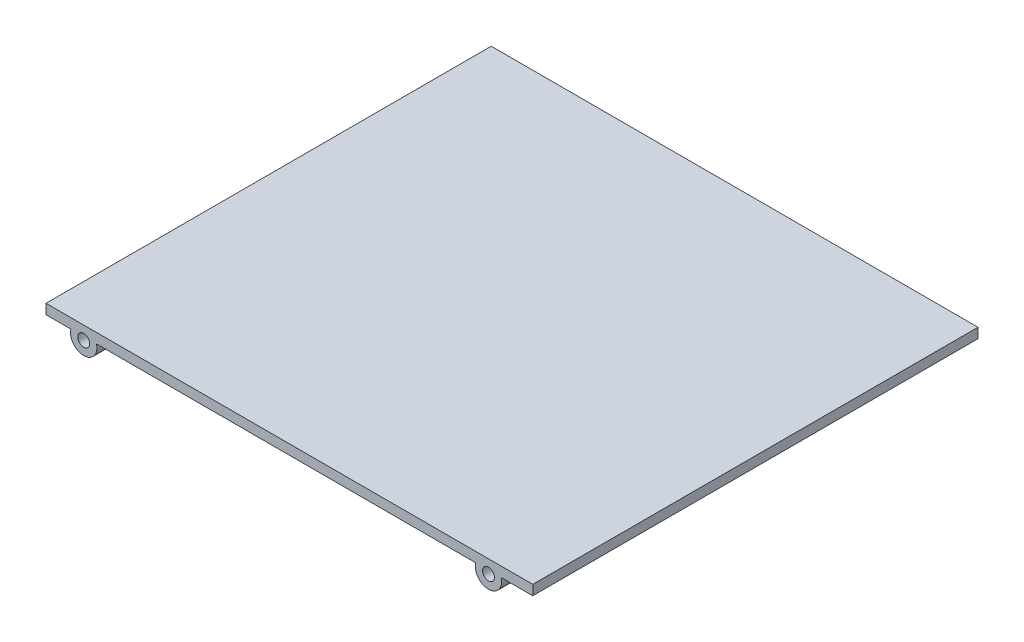
ISO-10303-21;
HEADER;
FILE_DESCRIPTION(('STEP AP214'),'2;1');
FILE_NAME('part.step','',(''),(''),'','','');
FILE_SCHEMA(('AUTOMOTIVE_DESIGN { 1 0 10303 214 1 1 1 1 }'));
ENDSEC;
DATA;
#1=APPLICATION_CONTEXT('core data for automotive mechanical design processes');
#2=APPLICATION_PROTOCOL_DEFINITION('international standard','automotive_design',2000,#1);
#3=PRODUCT_CONTEXT('',#1,'mechanical');
#4=PRODUCT('Part','Part','',(#3));
#5=PRODUCT_RELATED_PRODUCT_CATEGORY('part','',(#4));
#6=PRODUCT_DEFINITION_FORMATION('','',#4);
#7=PRODUCT_DEFINITION_CONTEXT('part definition',#1,'design');
#8=PRODUCT_DEFINITION('design','',#6,#7);
#9=PRODUCT_DEFINITION_SHAPE('','',#8);
#10=(LENGTH_UNIT() NAMED_UNIT(*) SI_UNIT(.MILLI.,.METRE.));
#11=(NAMED_UNIT(*) PLANE_ANGLE_UNIT() SI_UNIT($,.RADIAN.));
#12=(NAMED_UNIT(*) SI_UNIT($,.STERADIAN.) SOLID_ANGLE_UNIT());
#13=UNCERTAINTY_MEASURE_WITH_UNIT(LENGTH_MEASURE(1.E-05),#10,'distance_accuracy_value','');
#14=(GEOMETRIC_REPRESENTATION_CONTEXT(3) GLOBAL_UNCERTAINTY_ASSIGNED_CONTEXT((#13)) GLOBAL_UNIT_ASSIGNED_CONTEXT((#10,
#11,#12)) REPRESENTATION_CONTEXT('',''));
#15=CARTESIAN_POINT('',(0.,0.,0.));
#16=DIRECTION('',(0.,0.,1.));
#17=DIRECTION('',(1.,0.,0.));
#18=AXIS2_PLACEMENT_3D('',#15,#16,#17);
#19=CARTESIAN_POINT('',(-215.790530374135,19.6324924250548,141.061835141856));
#20=DIRECTION('',(-1.,0.,0.));
#21=DIRECTION('',(0.,0.,1.));
#22=AXIS2_PLACEMENT_3D('',#19,#20,#21);
#23=PLANE('',#22);
#24=DIRECTION('',(0.,1.,0.));
#25=VECTOR('',#24,1.);
#26=CARTESIAN_POINT('',(-215.790530374135,19.6324924250548,67.380000000001));
#27=LINE('',#26,#25);
#28=CARTESIAN_POINT('',(-215.790530374135,18.1324924250559,67.380000000001));
#29=VERTEX_POINT('',#28);
#30=CARTESIAN_POINT('',(-215.790530374135,19.6324924250548,67.3800000000009));
#31=VERTEX_POINT('',#30);
#32=EDGE_CURVE('E220',#29,#31,#27,.T.);
#33=ORIENTED_EDGE('',*,*,#32,.F.);
#34=DIRECTION('',(0.,0.,-1.));
#35=VECTOR('',#34,1.);
#36=CARTESIAN_POINT('',(-215.790530374135,18.1324924250559,141.061835141856));
#37=LINE('',#36,#35);
#38=CARTESIAN_POINT('',(-215.790530374135,18.1324924250559,0.));
#39=VERTEX_POINT('',#38);
#40=EDGE_CURVE('E202',#29,#39,#37,.T.);
#41=ORIENTED_EDGE('',*,*,#40,.T.);
#42=DIRECTION('',(0.,1.,0.));
#43=VECTOR('',#42,1.);
#44=CARTESIAN_POINT('',(-215.790530374135,19.6324924250548,0.));
#45=LINE('',#44,#43);
#46=CARTESIAN_POINT('',(-215.790530374135,19.6324924250548,0.));
#47=VERTEX_POINT('',#46);
#48=EDGE_CURVE('E205',#39,#47,#45,.T.);
#49=ORIENTED_EDGE('',*,*,#48,.T.);
#50=DIRECTION('',(0.,0.,-1.));
#51=VECTOR('',#50,1.);
#52=CARTESIAN_POINT('',(-215.790530374135,19.6324924250548,141.061835141856));
#53=LINE('',#52,#51);
#54=EDGE_CURVE('E215',#31,#47,#53,.T.);
#55=ORIENTED_EDGE('',*,*,#54,.F.);
#56=EDGE_LOOP('',(#33,#41,#49,#55));
#57=FACE_BOUND('',#56,.T.);
#58=ADVANCED_FACE('F39',(#57),#23,.F.);
#59=CARTESIAN_POINT('',(-289.457095584354,19.6324924250548,141.061835141856));
#60=DIRECTION('',(0.,-1.,0.));
#61=DIRECTION('',(0.,0.,-1.));
#62=AXIS2_PLACEMENT_3D('',#59,#60,#61);
#63=PLANE('',#62);
#64=DIRECTION('',(0.,0.,-1.));
#65=VECTOR('',#64,1.);
#66=CARTESIAN_POINT('',(-289.457095584354,19.6324924250548,141.061835141856));
#67=LINE('',#66,#65);
#68=CARTESIAN_POINT('',(-289.457095584354,19.6324924250548,67.3800000000009));
#69=VERTEX_POINT('',#68);
#70=CARTESIAN_POINT('',(-289.457095584354,19.6324924250548,0.));
#71=VERTEX_POINT('',#70);
#72=EDGE_CURVE('E211',#69,#71,#67,.T.);
#73=ORIENTED_EDGE('',*,*,#72,.F.);
#74=DIRECTION('',(-1.,0.,0.));
#75=VECTOR('',#74,1.);
#76=CARTESIAN_POINT('',(-289.457095584354,19.6324924250548,67.3800000000009));
#77=LINE('',#76,#75);
#78=EDGE_CURVE('E225',#31,#69,#77,.T.);
#79=ORIENTED_EDGE('',*,*,#78,.F.);
#80=ORIENTED_EDGE('',*,*,#54,.T.);
#81=DIRECTION('',(-1.,0.,0.));
#82=VECTOR('',#81,1.);
#83=CARTESIAN_POINT('',(-289.457095584354,19.6324924250548,0.));
#84=LINE('',#83,#82);
#85=EDGE_CURVE('E214',#47,#71,#84,.T.);
#86=ORIENTED_EDGE('',*,*,#85,.T.);
#87=EDGE_LOOP('',(#73,#79,#80,#86));
#88=FACE_BOUND('',#87,.T.);
#89=ADVANCED_FACE('F319',(#88),#63,.F.);
#90=CARTESIAN_POINT('',(-289.457095584354,18.132492425055,141.061835141856));
#91=DIRECTION('',(1.,0.,0.));
#92=DIRECTION('',(0.,1.,0.));
#93=AXIS2_PLACEMENT_3D('',#90,#91,#92);
#94=PLANE('',#93);
#95=DIRECTION('',(0.,-1.,0.));
#96=VECTOR('',#95,1.);
#97=CARTESIAN_POINT('',(-289.457095584354,18.132492425055,67.3800000000009));
#98=LINE('',#97,#96);
#99=CARTESIAN_POINT('',(-289.457095584354,18.132492425055,67.3800000000009));
#100=VERTEX_POINT('',#99);
#101=EDGE_CURVE('E227',#69,#100,#98,.T.);
#102=ORIENTED_EDGE('',*,*,#101,.F.);
#103=ORIENTED_EDGE('',*,*,#72,.T.);
#104=DIRECTION('',(0.,-1.,0.));
#105=VECTOR('',#104,1.);
#106=CARTESIAN_POINT('',(-289.457095584354,18.132492425055,0.));
#107=LINE('',#106,#105);
#108=CARTESIAN_POINT('',(-289.457095584354,18.132492425055,0.));
#109=VERTEX_POINT('',#108);
#110=EDGE_CURVE('E210',#71,#109,#107,.T.);
#111=ORIENTED_EDGE('',*,*,#110,.T.);
#112=DIRECTION('',(0.,0.,-1.));
#113=VECTOR('',#112,1.);
#114=CARTESIAN_POINT('',(-289.457095584354,18.132492425055,141.061835141856));
#115=LINE('',#114,#113);
#116=EDGE_CURVE('E207',#100,#109,#115,.T.);
#117=ORIENTED_EDGE('',*,*,#116,.F.);
#118=EDGE_LOOP('',(#102,#103,#111,#117));
#119=FACE_BOUND('',#118,.T.);
#120=ADVANCED_FACE('F325',(#119),#94,.F.);
#121=CARTESIAN_POINT('',(-215.790530374135,18.1324924250559,141.061835141856));
#122=DIRECTION('',(0.,1.,0.));
#123=DIRECTION('',(-1.,0.,0.));
#124=AXIS2_PLACEMENT_3D('',#121,#122,#123);
#125=PLANE('',#124);
#126=DIRECTION('',(1.,0.,0.));
#127=VECTOR('',#126,1.);
#128=CARTESIAN_POINT('',(-215.790530374135,18.1324924250559,59.3800000000013));
#129=LINE('',#128,#127);
#130=CARTESIAN_POINT('',(-224.428044512183,18.1324924250558,59.3800000000013));
#131=VERTEX_POINT('',#130);
#132=CARTESIAN_POINT('',(-223.239884316434,18.1324924250558,59.3800000000013));
#133=VERTEX_POINT('',#132);
#134=EDGE_CURVE('E155',#131,#133,#129,.T.);
#135=ORIENTED_EDGE('',*,*,#134,.F.);
#136=DIRECTION('',(0.,0.,1.));
#137=VECTOR('',#136,1.);
#138=CARTESIAN_POINT('',(-224.428044512183,18.1324924250558,59.3800000000013));
#139=LINE('',#138,#137);
#140=CARTESIAN_POINT('',(-224.428044512183,18.1324924250558,67.3800000000013));
#141=VERTEX_POINT('',#140);
#142=EDGE_CURVE('E266',#131,#141,#139,.T.);
#143=ORIENTED_EDGE('',*,*,#142,.T.);
#144=DIRECTION('',(1.,0.,0.));
#145=VECTOR('',#144,1.);
#146=CARTESIAN_POINT('',(-215.790530374135,18.1324924250559,67.380000000001));
#147=LINE('',#146,#145);
#148=CARTESIAN_POINT('',(-281.813961070135,18.1324924250551,67.3800000000009));
#149=VERTEX_POINT('',#148);
#150=EDGE_CURVE('E221',#149,#141,#147,.T.);
#151=ORIENTED_EDGE('',*,*,#150,.F.);
#152=DIRECTION('',(0.,0.,1.));
#153=VECTOR('',#152,1.);
#154=CARTESIAN_POINT('',(-281.813961070135,18.1324924250551,59.3800000000013));
#155=LINE('',#154,#153);
#156=CARTESIAN_POINT('',(-281.813961070135,18.1324924250551,59.3800000000013));
#157=VERTEX_POINT('',#156);
#158=EDGE_CURVE('E280',#149,#157,#155,.F.);
#159=ORIENTED_EDGE('',*,*,#158,.T.);
#160=DIRECTION('',(1.,0.,0.));
#161=VECTOR('',#160,1.);
#162=CARTESIAN_POINT('',(-215.790530374135,18.1324924250559,59.3800000000013));
#163=LINE('',#162,#161);
#164=CARTESIAN_POINT('',(-283.002121265884,18.1324924250551,59.3800000000013));
#165=VERTEX_POINT('',#164);
#166=EDGE_CURVE('E177',#165,#157,#163,.T.);
#167=ORIENTED_EDGE('',*,*,#166,.F.);
#168=CARTESIAN_POINT('',(-284.498784220593,18.1324924250551,59.3800000000013));
#169=VERTEX_POINT('',#168);
#170=EDGE_CURVE('E176',#169,#165,#163,.T.);
#171=ORIENTED_EDGE('',*,*,#170,.F.);
#172=CARTESIAN_POINT('',(-285.686944416343,18.1324924250551,59.3800000000013));
#173=VERTEX_POINT('',#172);
#174=EDGE_CURVE('E174',#173,#169,#163,.T.);
#175=ORIENTED_EDGE('',*,*,#174,.F.);
#176=DIRECTION('',(0.,0.,1.));
#177=VECTOR('',#176,1.);
#178=CARTESIAN_POINT('',(-285.686944416343,18.1324924250551,59.3800000000013));
#179=LINE('',#178,#177);
#180=CARTESIAN_POINT('',(-285.686944416343,18.1324924250551,67.3800000000013));
#181=VERTEX_POINT('',#180);
#182=EDGE_CURVE('E277',#173,#181,#179,.T.);
#183=ORIENTED_EDGE('',*,*,#182,.T.);
#184=EDGE_CURVE('E217',#100,#181,#147,.T.);
#185=ORIENTED_EDGE('',*,*,#184,.F.);
#186=ORIENTED_EDGE('',*,*,#116,.T.);
#187=DIRECTION('',(1.,0.,0.));
#188=VECTOR('',#187,1.);
#189=CARTESIAN_POINT('',(-215.790530374135,18.1324924250559,0.));
#190=LINE('',#189,#188);
#191=CARTESIAN_POINT('',(-285.686944416342,18.1324924250551,0.));
#192=VERTEX_POINT('',#191);
#193=EDGE_CURVE('E235',#109,#192,#190,.T.);
#194=ORIENTED_EDGE('',*,*,#193,.T.);
#195=DIRECTION('',(0.,0.,-1.));
#196=VECTOR('',#195,1.);
#197=CARTESIAN_POINT('',(-285.686944416342,18.1324924250551,8.));
#198=LINE('',#197,#196);
#199=CARTESIAN_POINT('',(-285.686944416342,18.1324924250551,8.));
#200=VERTEX_POINT('',#199);
#201=EDGE_CURVE('E240',#192,#200,#198,.F.);
#202=ORIENTED_EDGE('',*,*,#201,.T.);
#203=DIRECTION('',(-1.,0.,0.));
#204=VECTOR('',#203,1.);
#205=CARTESIAN_POINT('',(-215.790530374135,18.1324924250559,8.00000000000001));
#206=LINE('',#205,#204);
#207=CARTESIAN_POINT('',(-284.498784220593,18.1324924250551,8.));
#208=VERTEX_POINT('',#207);
#209=EDGE_CURVE('E197',#208,#200,#206,.T.);
#210=ORIENTED_EDGE('',*,*,#209,.F.);
#211=CARTESIAN_POINT('',(-283.002121265884,18.1324924250551,8.));
#212=VERTEX_POINT('',#211);
#213=EDGE_CURVE('E196',#212,#208,#206,.T.);
#214=ORIENTED_EDGE('',*,*,#213,.F.);
#215=CARTESIAN_POINT('',(-281.813961070134,18.1324924250551,8.));
#216=VERTEX_POINT('',#215);
#217=EDGE_CURVE('E191',#216,#212,#206,.T.);
#218=ORIENTED_EDGE('',*,*,#217,.F.);
#219=DIRECTION('',(0.,0.,-1.));
#220=VECTOR('',#219,1.);
#221=CARTESIAN_POINT('',(-281.813961070134,18.1324924250551,8.));
#222=LINE('',#221,#220);
#223=CARTESIAN_POINT('',(-281.813961070134,18.1324924250551,0.));
#224=VERTEX_POINT('',#223);
#225=EDGE_CURVE('E206',#216,#224,#222,.T.);
#226=ORIENTED_EDGE('',*,*,#225,.T.);
#227=CARTESIAN_POINT('',(-224.428044512183,18.1324924250558,0.));
#228=VERTEX_POINT('',#227);
#229=EDGE_CURVE('E237',#224,#228,#190,.T.);
#230=ORIENTED_EDGE('',*,*,#229,.T.);
#231=DIRECTION('',(0.,0.,-1.));
#232=VECTOR('',#231,1.);
#233=CARTESIAN_POINT('',(-224.428044512183,18.1324924250558,8.));
#234=LINE('',#233,#232);
#235=CARTESIAN_POINT('',(-224.428044512183,18.1324924250558,8.));
#236=VERTEX_POINT('',#235);
#237=EDGE_CURVE('E246',#228,#236,#234,.F.);
#238=ORIENTED_EDGE('',*,*,#237,.T.);
#239=DIRECTION('',(-1.,0.,0.));
#240=VECTOR('',#239,1.);
#241=CARTESIAN_POINT('',(-215.790530374135,18.1324924250559,8.00000000000001));
#242=LINE('',#241,#240);
#243=CARTESIAN_POINT('',(-223.239884316433,18.1324924250558,8.));
#244=VERTEX_POINT('',#243);
#245=EDGE_CURVE('E201',#244,#236,#242,.T.);
#246=ORIENTED_EDGE('',*,*,#245,.F.);
#247=CARTESIAN_POINT('',(-221.743221361725,18.1324924250558,8.));
#248=VERTEX_POINT('',#247);
#249=EDGE_CURVE('E200',#248,#244,#242,.T.);
#250=ORIENTED_EDGE('',*,*,#249,.F.);
#251=CARTESIAN_POINT('',(-220.555061165975,18.1324924250559,8.));
#252=VERTEX_POINT('',#251);
#253=EDGE_CURVE('E198',#252,#248,#242,.T.);
#254=ORIENTED_EDGE('',*,*,#253,.F.);
#255=DIRECTION('',(0.,0.,-1.));
#256=VECTOR('',#255,1.);
#257=CARTESIAN_POINT('',(-220.555061165975,18.1324924250559,8.));
#258=LINE('',#257,#256);
#259=CARTESIAN_POINT('',(-220.555061165975,18.1324924250559,0.));
#260=VERTEX_POINT('',#259);
#261=EDGE_CURVE('E243',#252,#260,#258,.T.);
#262=ORIENTED_EDGE('',*,*,#261,.T.);
#263=EDGE_CURVE('E209',#260,#39,#190,.T.);
#264=ORIENTED_EDGE('',*,*,#263,.T.);
#265=ORIENTED_EDGE('',*,*,#40,.F.);
#266=CARTESIAN_POINT('',(-220.555061165976,18.1324924250559,67.380000000001));
#267=VERTEX_POINT('',#266);
#268=EDGE_CURVE('E222',#267,#29,#147,.T.);
#269=ORIENTED_EDGE('',*,*,#268,.F.);
#270=DIRECTION('',(0.,0.,1.));
#271=VECTOR('',#270,1.);
#272=CARTESIAN_POINT('',(-220.555061165976,18.1324924250559,59.3800000000013));
#273=LINE('',#272,#271);
#274=CARTESIAN_POINT('',(-220.555061165976,18.1324924250559,59.3800000000013));
#275=VERTEX_POINT('',#274);
#276=EDGE_CURVE('E275',#267,#275,#273,.F.);
#277=ORIENTED_EDGE('',*,*,#276,.T.);
#278=CARTESIAN_POINT('',(-221.743221361726,18.1324924250558,59.3800000000013));
#279=VERTEX_POINT('',#278);
#280=EDGE_CURVE('E167',#279,#275,#129,.T.);
#281=ORIENTED_EDGE('',*,*,#280,.F.);
#282=EDGE_CURVE('E159',#133,#279,#129,.T.);
#283=ORIENTED_EDGE('',*,*,#282,.F.);
#284=EDGE_LOOP('',(#135,#143,#151,#159,#167,#171,#175,#183,#185,#186,#194,#202,#210,#214,#218,
#226,#230,#238,#246,#250,#254,#262,#264,#265,#269,#277,#281,#283));
#285=FACE_BOUND('',#284,.T.);
#286=ADVANCED_FACE('F164',(#285),#125,.F.);
#287=CARTESIAN_POINT('',(0.,0.,0.));
#288=DIRECTION('',(0.,0.,-1.));
#289=DIRECTION('',(-1.,0.,0.));
#290=AXIS2_PLACEMENT_3D('',#287,#288,#289);
#291=PLANE('',#290);
#292=CARTESIAN_POINT('',(-222.491552839079,17.6324924250544,0.));
#293=DIRECTION('',(0.,0.,-1.));
#294=DIRECTION('',(-1.,0.,0.));
#295=AXIS2_PLACEMENT_3D('',#292,#293,#294);
#296=CIRCLE('',#295,0.900000000000028);
#297=CARTESIAN_POINT('',(-223.391552839079,17.6324924250544,0.));
#298=VERTEX_POINT('',#297);
#299=EDGE_CURVE('E269',#298,#298,#296,.T.);
#300=ORIENTED_EDGE('',*,*,#299,.F.);
#301=EDGE_LOOP('',(#300));
#302=FACE_BOUND('',#301,.T.);
#303=CARTESIAN_POINT('',(-283.750452743238,17.6324924250544,0.));
#304=DIRECTION('',(0.,0.,-1.));
#305=DIRECTION('',(-1.,0.,0.));
#306=AXIS2_PLACEMENT_3D('',#303,#304,#305);
#307=CIRCLE('',#306,0.900000000000001);
#308=CARTESIAN_POINT('',(-284.650452743238,17.6324924250544,0.));
#309=VERTEX_POINT('',#308);
#310=EDGE_CURVE('E265',#309,#309,#307,.T.);
#311=ORIENTED_EDGE('',*,*,#310,.F.);
#312=EDGE_LOOP('',(#311));
#313=FACE_BOUND('',#312,.T.);
#314=ORIENTED_EDGE('',*,*,#263,.F.);
#315=CARTESIAN_POINT('',(-222.491552839079,17.6324924250544,0.));
#316=DIRECTION('',(0.,0.,-1.));
#317=DIRECTION('',(-1.,0.,0.));
#318=AXIS2_PLACEMENT_3D('',#315,#316,#317);
#319=CIRCLE('',#318,2.00000000000059);
#320=EDGE_CURVE('E253',#260,#228,#319,.T.);
#321=ORIENTED_EDGE('',*,*,#320,.T.);
#322=ORIENTED_EDGE('',*,*,#229,.F.);
#323=CARTESIAN_POINT('',(-283.750452743238,17.6324924250544,0.));
#324=DIRECTION('',(0.,0.,-1.));
#325=DIRECTION('',(-1.,0.,0.));
#326=AXIS2_PLACEMENT_3D('',#323,#324,#325);
#327=CIRCLE('',#326,2.00000000000071);
#328=EDGE_CURVE('E257',#224,#192,#327,.T.);
#329=ORIENTED_EDGE('',*,*,#328,.T.);
#330=ORIENTED_EDGE('',*,*,#193,.F.);
#331=ORIENTED_EDGE('',*,*,#110,.F.);
#332=ORIENTED_EDGE('',*,*,#85,.F.);
#333=ORIENTED_EDGE('',*,*,#48,.F.);
#334=EDGE_LOOP('',(#314,#321,#322,#329,#330,#331,#332,#333));
#335=FACE_BOUND('',#334,.T.);
#336=ADVANCED_FACE('F334',(#302,#313,#335),#291,.T.);
#337=CARTESIAN_POINT('',(-53.15,-0.367507574945569,67.3800000000013));
#338=DIRECTION('',(0.,0.,1.));
#339=DIRECTION('',(0.999885624174656,-0.0151241055556286,0.));
#340=AXIS2_PLACEMENT_3D('',#337,#338,#339);
#341=PLANE('',#340);
#342=CARTESIAN_POINT('',(-283.750452743239,17.6324924250544,67.3800000000013));
#343=DIRECTION('',(0.,0.,1.));
#344=DIRECTION('',(1.,0.,0.));
#345=AXIS2_PLACEMENT_3D('',#342,#343,#344);
#346=CIRCLE('',#345,0.90000000000011);
#347=CARTESIAN_POINT('',(-282.850452743239,17.6324924250544,67.3800000000013));
#348=VERTEX_POINT('',#347);
#349=EDGE_CURVE('E292',#348,#348,#346,.T.);
#350=ORIENTED_EDGE('',*,*,#349,.F.);
#351=EDGE_LOOP('',(#350));
#352=FACE_BOUND('',#351,.T.);
#353=CARTESIAN_POINT('',(-222.49155283908,17.6324924250544,67.3800000000013));
#354=DIRECTION('',(0.,0.,1.));
#355=DIRECTION('',(1.,0.,0.));
#356=AXIS2_PLACEMENT_3D('',#353,#354,#355);
#357=CIRCLE('',#356,0.90000000000011);
#358=CARTESIAN_POINT('',(-221.591552839079,17.6324924250544,67.3800000000013));
#359=VERTEX_POINT('',#358);
#360=EDGE_CURVE('E160',#359,#359,#357,.T.);
#361=ORIENTED_EDGE('',*,*,#360,.F.);
#362=EDGE_LOOP('',(#361));
#363=FACE_BOUND('',#362,.T.);
#364=ORIENTED_EDGE('',*,*,#184,.T.);
#365=CARTESIAN_POINT('',(-283.750452743239,17.6324924250544,67.3800000000013));
#366=DIRECTION('',(0.,0.,1.));
#367=DIRECTION('',(1.,0.,0.));
#368=AXIS2_PLACEMENT_3D('',#365,#366,#367);
#369=CIRCLE('',#368,2.00000000000051);
#370=EDGE_CURVE('E285',#181,#149,#369,.T.);
#371=ORIENTED_EDGE('',*,*,#370,.T.);
#372=ORIENTED_EDGE('',*,*,#150,.T.);
#373=CARTESIAN_POINT('',(-222.49155283908,17.6324924250544,67.3800000000013));
#374=DIRECTION('',(0.,0.,1.));
#375=DIRECTION('',(1.,0.,0.));
#376=AXIS2_PLACEMENT_3D('',#373,#374,#375);
#377=CIRCLE('',#376,2.00000000000033);
#378=EDGE_CURVE('E287',#141,#267,#377,.T.);
#379=ORIENTED_EDGE('',*,*,#378,.T.);
#380=ORIENTED_EDGE('',*,*,#268,.T.);
#381=ORIENTED_EDGE('',*,*,#32,.T.);
#382=ORIENTED_EDGE('',*,*,#78,.T.);
#383=ORIENTED_EDGE('',*,*,#101,.T.);
#384=EDGE_LOOP('',(#364,#371,#372,#379,#380,#381,#382,#383));
#385=FACE_BOUND('',#384,.T.);
#386=ADVANCED_FACE('F41',(#352,#363,#385),#341,.T.);
#387=CARTESIAN_POINT('',(-222.491552839079,17.6324924250544,8.));
#388=DIRECTION('',(0.,0.,-1.));
#389=DIRECTION('',(-1.,0.,0.));
#390=AXIS2_PLACEMENT_3D('',#387,#388,#389);
#391=PLANE('',#390);
#392=ORIENTED_EDGE('',*,*,#253,.T.);
#393=CARTESIAN_POINT('',(-222.491552839079,17.6324924250544,8.));
#394=DIRECTION('',(0.,0.,-1.));
#395=DIRECTION('',(-1.,0.,0.));
#396=AXIS2_PLACEMENT_3D('',#393,#394,#395);
#397=CIRCLE('',#396,0.900000000000028);
#398=EDGE_CURVE('E182',#248,#244,#397,.T.);
#399=ORIENTED_EDGE('',*,*,#398,.T.);
#400=ORIENTED_EDGE('',*,*,#245,.T.);
#401=CARTESIAN_POINT('',(-222.491552839079,17.6324924250544,8.));
#402=DIRECTION('',(0.,0.,-1.));
#403=DIRECTION('',(-1.,0.,0.));
#404=AXIS2_PLACEMENT_3D('',#401,#402,#403);
#405=CIRCLE('',#404,2.00000000000059);
#406=EDGE_CURVE('E250',#252,#236,#405,.T.);
#407=ORIENTED_EDGE('',*,*,#406,.F.);
#408=EDGE_LOOP('',(#392,#399,#400,#407));
#409=FACE_BOUND('',#408,.T.);
#410=ADVANCED_FACE('F338',(#409),#391,.F.);
#411=CARTESIAN_POINT('',(-222.491552839079,17.6324924250544,8.));
#412=DIRECTION('',(0.,0.,-1.));
#413=DIRECTION('',(-1.,0.,0.));
#414=AXIS2_PLACEMENT_3D('',#411,#412,#413);
#415=CYLINDRICAL_SURFACE('',#414,2.00000000000059);
#416=ORIENTED_EDGE('',*,*,#261,.F.);
#417=ORIENTED_EDGE('',*,*,#406,.T.);
#418=ORIENTED_EDGE('',*,*,#237,.F.);
#419=ORIENTED_EDGE('',*,*,#320,.F.);
#420=EDGE_LOOP('',(#416,#417,#418,#419));
#421=FACE_BOUND('',#420,.T.);
#422=ADVANCED_FACE('F341',(#421),#415,.T.);
#423=CARTESIAN_POINT('',(-283.750452743238,17.6324924250544,8.));
#424=DIRECTION('',(0.,0.,-1.));
#425=DIRECTION('',(-1.,0.,0.));
#426=AXIS2_PLACEMENT_3D('',#423,#424,#425);
#427=PLANE('',#426);
#428=ORIENTED_EDGE('',*,*,#217,.T.);
#429=CARTESIAN_POINT('',(-283.750452743238,17.6324924250544,8.));
#430=DIRECTION('',(0.,0.,-1.));
#431=DIRECTION('',(-1.,0.,0.));
#432=AXIS2_PLACEMENT_3D('',#429,#430,#431);
#433=CIRCLE('',#432,0.900000000000001);
#434=EDGE_CURVE('E186',#212,#208,#433,.T.);
#435=ORIENTED_EDGE('',*,*,#434,.T.);
#436=ORIENTED_EDGE('',*,*,#209,.T.);
#437=CARTESIAN_POINT('',(-283.750452743238,17.6324924250544,8.));
#438=DIRECTION('',(0.,0.,-1.));
#439=DIRECTION('',(-1.,0.,0.));
#440=AXIS2_PLACEMENT_3D('',#437,#438,#439);
#441=CIRCLE('',#440,2.00000000000071);
#442=EDGE_CURVE('E249',#216,#200,#441,.T.);
#443=ORIENTED_EDGE('',*,*,#442,.F.);
#444=EDGE_LOOP('',(#428,#435,#436,#443));
#445=FACE_BOUND('',#444,.T.);
#446=ADVANCED_FACE('F344',(#445),#427,.F.);
#447=CARTESIAN_POINT('',(-283.750452743238,17.6324924250544,8.));
#448=DIRECTION('',(0.,0.,-1.));
#449=DIRECTION('',(-1.,0.,0.));
#450=AXIS2_PLACEMENT_3D('',#447,#448,#449);
#451=CYLINDRICAL_SURFACE('',#450,2.00000000000071);
#452=ORIENTED_EDGE('',*,*,#225,.F.);
#453=ORIENTED_EDGE('',*,*,#442,.T.);
#454=ORIENTED_EDGE('',*,*,#201,.F.);
#455=ORIENTED_EDGE('',*,*,#328,.F.);
#456=EDGE_LOOP('',(#452,#453,#454,#455));
#457=FACE_BOUND('',#456,.T.);
#458=ADVANCED_FACE('F346',(#457),#451,.T.);
#459=CARTESIAN_POINT('',(-283.750452743238,17.6324924250544,8.));
#460=DIRECTION('',(0.,0.,-1.));
#461=DIRECTION('',(-1.,0.,0.));
#462=AXIS2_PLACEMENT_3D('',#459,#460,#461);
#463=PLANE('',#462);
#464=ORIENTED_EDGE('',*,*,#213,.T.);
#465=CARTESIAN_POINT('',(-283.750452743238,17.6324924250544,8.));
#466=DIRECTION('',(0.,0.,-1.));
#467=DIRECTION('',(-1.,0.,0.));
#468=AXIS2_PLACEMENT_3D('',#465,#466,#467);
#469=CIRCLE('',#468,0.900000000000001);
#470=EDGE_CURVE('E262',#208,#212,#469,.T.);
#471=ORIENTED_EDGE('',*,*,#470,.T.);
#472=EDGE_LOOP('',(#464,#471));
#473=FACE_BOUND('',#472,.T.);
#474=ADVANCED_FACE('F349',(#473),#463,.T.);
#475=CARTESIAN_POINT('',(-283.750452743238,17.6324924250544,8.));
#476=DIRECTION('',(0.,0.,-1.));
#477=DIRECTION('',(-1.,0.,0.));
#478=AXIS2_PLACEMENT_3D('',#475,#476,#477);
#479=CYLINDRICAL_SURFACE('',#478,0.900000000000001);
#480=ORIENTED_EDGE('',*,*,#470,.F.);
#481=ORIENTED_EDGE('',*,*,#434,.F.);
#482=EDGE_LOOP('',(#480,#481));
#483=FACE_BOUND('',#482,.T.);
#484=ORIENTED_EDGE('',*,*,#310,.T.);
#485=EDGE_LOOP('',(#484));
#486=FACE_BOUND('',#485,.T.);
#487=ADVANCED_FACE('F356',(#483,#486),#479,.F.);
#488=CARTESIAN_POINT('',(-222.491552839079,17.6324924250544,8.));
#489=DIRECTION('',(0.,0.,-1.));
#490=DIRECTION('',(-1.,0.,0.));
#491=AXIS2_PLACEMENT_3D('',#488,#489,#490);
#492=PLANE('',#491);
#493=ORIENTED_EDGE('',*,*,#249,.T.);
#494=CARTESIAN_POINT('',(-222.491552839079,17.6324924250544,8.));
#495=DIRECTION('',(0.,0.,-1.));
#496=DIRECTION('',(-1.,0.,0.));
#497=AXIS2_PLACEMENT_3D('',#494,#495,#496);
#498=CIRCLE('',#497,0.900000000000028);
#499=EDGE_CURVE('E254',#244,#248,#498,.T.);
#500=ORIENTED_EDGE('',*,*,#499,.T.);
#501=EDGE_LOOP('',(#493,#500));
#502=FACE_BOUND('',#501,.T.);
#503=ADVANCED_FACE('F314',(#502),#492,.T.);
#504=CARTESIAN_POINT('',(-222.491552839079,17.6324924250544,8.));
#505=DIRECTION('',(0.,0.,-1.));
#506=DIRECTION('',(-1.,0.,0.));
#507=AXIS2_PLACEMENT_3D('',#504,#505,#506);
#508=CYLINDRICAL_SURFACE('',#507,0.900000000000028);
#509=ORIENTED_EDGE('',*,*,#499,.F.);
#510=ORIENTED_EDGE('',*,*,#398,.F.);
#511=EDGE_LOOP('',(#509,#510));
#512=FACE_BOUND('',#511,.T.);
#513=ORIENTED_EDGE('',*,*,#299,.T.);
#514=EDGE_LOOP('',(#513));
#515=FACE_BOUND('',#514,.T.);
#516=ADVANCED_FACE('F305',(#512,#515),#508,.F.);
#517=CARTESIAN_POINT('',(-283.750452743239,17.6324924250544,59.3800000000013));
#518=DIRECTION('',(0.,0.,1.));
#519=DIRECTION('',(1.,0.,0.));
#520=AXIS2_PLACEMENT_3D('',#517,#518,#519);
#521=PLANE('',#520);
#522=ORIENTED_EDGE('',*,*,#174,.T.);
#523=CARTESIAN_POINT('',(-283.750452743239,17.6324924250544,59.3800000000013));
#524=DIRECTION('',(0.,0.,1.));
#525=DIRECTION('',(1.,0.,0.));
#526=AXIS2_PLACEMENT_3D('',#523,#524,#525);
#527=CIRCLE('',#526,0.90000000000011);
#528=EDGE_CURVE('E11',#169,#165,#527,.T.);
#529=ORIENTED_EDGE('',*,*,#528,.T.);
#530=ORIENTED_EDGE('',*,*,#166,.T.);
#531=CARTESIAN_POINT('',(-283.750452743239,17.6324924250544,59.3800000000013));
#532=DIRECTION('',(0.,0.,1.));
#533=DIRECTION('',(1.,0.,0.));
#534=AXIS2_PLACEMENT_3D('',#531,#532,#533);
#535=CIRCLE('',#534,2.00000000000051);
#536=EDGE_CURVE('E283',#173,#157,#535,.T.);
#537=ORIENTED_EDGE('',*,*,#536,.F.);
#538=EDGE_LOOP('',(#522,#529,#530,#537));
#539=FACE_BOUND('',#538,.T.);
#540=ADVANCED_FACE('F303',(#539),#521,.F.);
#541=CARTESIAN_POINT('',(-283.750452743239,17.6324924250544,59.3800000000013));
#542=DIRECTION('',(0.,0.,1.));
#543=DIRECTION('',(1.,0.,0.));
#544=AXIS2_PLACEMENT_3D('',#541,#542,#543);
#545=CYLINDRICAL_SURFACE('',#544,2.00000000000051);
#546=ORIENTED_EDGE('',*,*,#182,.F.);
#547=ORIENTED_EDGE('',*,*,#536,.T.);
#548=ORIENTED_EDGE('',*,*,#158,.F.);
#549=ORIENTED_EDGE('',*,*,#370,.F.);
#550=EDGE_LOOP('',(#546,#547,#548,#549));
#551=FACE_BOUND('',#550,.T.);
#552=ADVANCED_FACE('F302',(#551),#545,.T.);
#553=CARTESIAN_POINT('',(-222.49155283908,17.6324924250544,59.3800000000013));
#554=DIRECTION('',(0.,0.,1.));
#555=DIRECTION('',(1.,0.,0.));
#556=AXIS2_PLACEMENT_3D('',#553,#554,#555);
#557=PLANE('',#556);
#558=ORIENTED_EDGE('',*,*,#134,.T.);
#559=CARTESIAN_POINT('',(-222.49155283908,17.6324924250544,59.3800000000013));
#560=DIRECTION('',(0.,0.,1.));
#561=DIRECTION('',(1.,0.,0.));
#562=AXIS2_PLACEMENT_3D('',#559,#560,#561);
#563=CIRCLE('',#562,0.90000000000011);
#564=EDGE_CURVE('E47',#133,#279,#563,.T.);
#565=ORIENTED_EDGE('',*,*,#564,.T.);
#566=ORIENTED_EDGE('',*,*,#280,.T.);
#567=CARTESIAN_POINT('',(-222.49155283908,17.6324924250544,59.3800000000013));
#568=DIRECTION('',(0.,0.,1.));
#569=DIRECTION('',(1.,0.,0.));
#570=AXIS2_PLACEMENT_3D('',#567,#568,#569);
#571=CIRCLE('',#570,2.00000000000033);
#572=EDGE_CURVE('E172',#131,#275,#571,.T.);
#573=ORIENTED_EDGE('',*,*,#572,.F.);
#574=EDGE_LOOP('',(#558,#565,#566,#573));
#575=FACE_BOUND('',#574,.T.);
#576=ADVANCED_FACE('F170',(#575),#557,.F.);
#577=CARTESIAN_POINT('',(-222.49155283908,17.6324924250544,59.3800000000013));
#578=DIRECTION('',(0.,0.,1.));
#579=DIRECTION('',(1.,0.,0.));
#580=AXIS2_PLACEMENT_3D('',#577,#578,#579);
#581=CYLINDRICAL_SURFACE('',#580,2.00000000000033);
#582=ORIENTED_EDGE('',*,*,#142,.F.);
#583=ORIENTED_EDGE('',*,*,#572,.T.);
#584=ORIENTED_EDGE('',*,*,#276,.F.);
#585=ORIENTED_EDGE('',*,*,#378,.F.);
#586=EDGE_LOOP('',(#582,#583,#584,#585));
#587=FACE_BOUND('',#586,.T.);
#588=ADVANCED_FACE('F384',(#587),#581,.T.);
#589=CARTESIAN_POINT('',(-222.49155283908,17.6324924250544,59.3800000000013));
#590=DIRECTION('',(0.,0.,1.));
#591=DIRECTION('',(1.,0.,0.));
#592=AXIS2_PLACEMENT_3D('',#589,#590,#591);
#593=PLANE('',#592);
#594=ORIENTED_EDGE('',*,*,#282,.T.);
#595=CARTESIAN_POINT('',(-222.49155283908,17.6324924250544,59.3800000000013));
#596=DIRECTION('',(0.,0.,1.));
#597=DIRECTION('',(1.,0.,0.));
#598=AXIS2_PLACEMENT_3D('',#595,#596,#597);
#599=CIRCLE('',#598,0.90000000000011);
#600=EDGE_CURVE('E60',#279,#133,#599,.T.);
#601=ORIENTED_EDGE('',*,*,#600,.T.);
#602=EDGE_LOOP('',(#594,#601));
#603=FACE_BOUND('',#602,.T.);
#604=ADVANCED_FACE('F158',(#603),#593,.T.);
#605=CARTESIAN_POINT('',(-222.49155283908,17.6324924250544,59.3800000000013));
#606=DIRECTION('',(0.,0.,1.));
#607=DIRECTION('',(1.,0.,0.));
#608=AXIS2_PLACEMENT_3D('',#605,#606,#607);
#609=CYLINDRICAL_SURFACE('',#608,0.90000000000011);
#610=ORIENTED_EDGE('',*,*,#600,.F.);
#611=ORIENTED_EDGE('',*,*,#564,.F.);
#612=EDGE_LOOP('',(#610,#611));
#613=FACE_BOUND('',#612,.T.);
#614=ORIENTED_EDGE('',*,*,#360,.T.);
#615=EDGE_LOOP('',(#614));
#616=FACE_BOUND('',#615,.T.);
#617=ADVANCED_FACE('F150',(#613,#616),#609,.F.);
#618=CARTESIAN_POINT('',(-283.750452743239,17.6324924250544,59.3800000000013));
#619=DIRECTION('',(0.,0.,1.));
#620=DIRECTION('',(1.,0.,0.));
#621=AXIS2_PLACEMENT_3D('',#618,#619,#620);
#622=PLANE('',#621);
#623=ORIENTED_EDGE('',*,*,#170,.T.);
#624=CARTESIAN_POINT('',(-283.750452743239,17.6324924250544,59.3800000000013));
#625=DIRECTION('',(0.,0.,1.));
#626=DIRECTION('',(1.,0.,0.));
#627=AXIS2_PLACEMENT_3D('',#624,#625,#626);
#628=CIRCLE('',#627,0.90000000000011);
#629=EDGE_CURVE('E53',#165,#169,#628,.T.);
#630=ORIENTED_EDGE('',*,*,#629,.T.);
#631=EDGE_LOOP('',(#623,#630));
#632=FACE_BOUND('',#631,.T.);
#633=ADVANCED_FACE('F297',(#632),#622,.T.);
#634=CARTESIAN_POINT('',(-283.750452743239,17.6324924250544,59.3800000000013));
#635=DIRECTION('',(0.,0.,1.));
#636=DIRECTION('',(1.,0.,0.));
#637=AXIS2_PLACEMENT_3D('',#634,#635,#636);
#638=CYLINDRICAL_SURFACE('',#637,0.90000000000011);
#639=ORIENTED_EDGE('',*,*,#629,.F.);
#640=ORIENTED_EDGE('',*,*,#528,.F.);
#641=EDGE_LOOP('',(#639,#640));
#642=FACE_BOUND('',#641,.T.);
#643=ORIENTED_EDGE('',*,*,#349,.T.);
#644=EDGE_LOOP('',(#643));
#645=FACE_BOUND('',#644,.T.);
#646=ADVANCED_FACE('F395',(#642,#645),#638,.F.);
#647=CLOSED_SHELL('',(#58,#89,#120,#286,#336,#386,#410,#422,#446,#458,#474,#487,#503,#516,#540,
#552,#576,#588,#604,#617,#633,#646));
#648=MANIFOLD_SOLID_BREP('B2',#647);
#649=ADVANCED_BREP_SHAPE_REPRESENTATION('',(#18,#648),#14);
#650=SHAPE_DEFINITION_REPRESENTATION(#9,#649);
ENDSEC;
END-ISO-10303-21;
